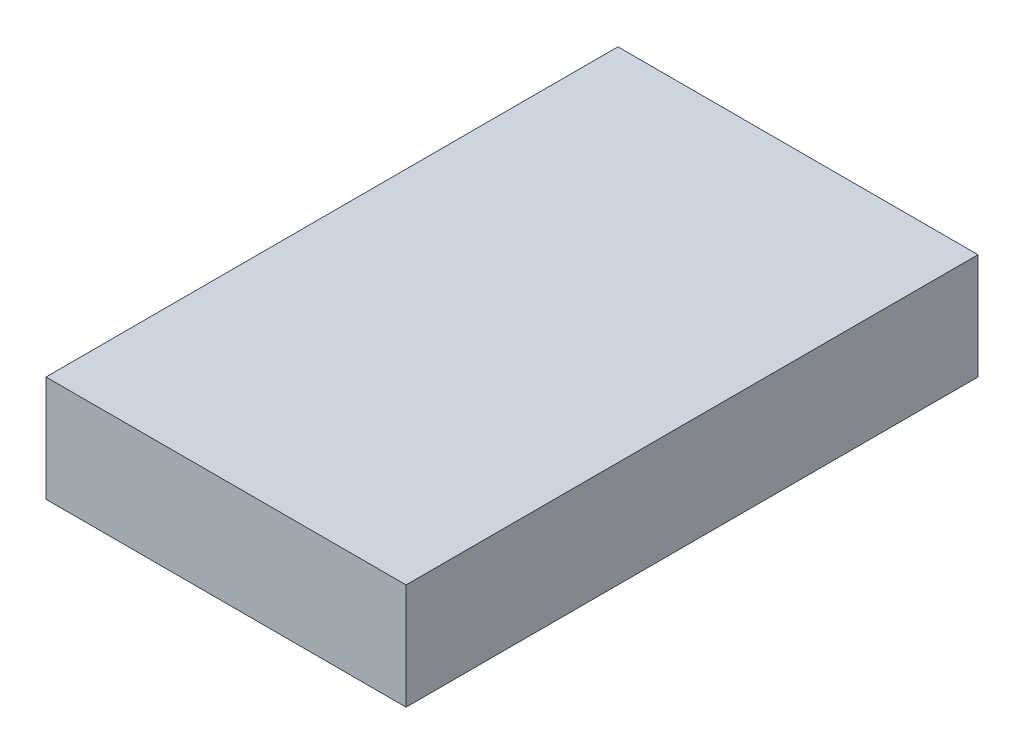
ISO-10303-21;
HEADER;
FILE_DESCRIPTION(('STEP AP214'),'2;1');
FILE_NAME('part.step','',(''),(''),'','','');
FILE_SCHEMA(('AUTOMOTIVE_DESIGN { 1 0 10303 214 1 1 1 1 }'));
ENDSEC;
DATA;
#1=APPLICATION_CONTEXT('core data for automotive mechanical design processes');
#2=APPLICATION_PROTOCOL_DEFINITION('international standard','automotive_design',2000,#1);
#3=PRODUCT_CONTEXT('',#1,'mechanical');
#4=PRODUCT('Part','Part','',(#3));
#5=PRODUCT_RELATED_PRODUCT_CATEGORY('part','',(#4));
#6=PRODUCT_DEFINITION_FORMATION('','',#4);
#7=PRODUCT_DEFINITION_CONTEXT('part definition',#1,'design');
#8=PRODUCT_DEFINITION('design','',#6,#7);
#9=PRODUCT_DEFINITION_SHAPE('','',#8);
#10=(LENGTH_UNIT() NAMED_UNIT(*) SI_UNIT(.MILLI.,.METRE.));
#11=(NAMED_UNIT(*) PLANE_ANGLE_UNIT() SI_UNIT($,.RADIAN.));
#12=(NAMED_UNIT(*) SI_UNIT($,.STERADIAN.) SOLID_ANGLE_UNIT());
#13=UNCERTAINTY_MEASURE_WITH_UNIT(LENGTH_MEASURE(1.E-05),#10,'distance_accuracy_value','');
#14=(GEOMETRIC_REPRESENTATION_CONTEXT(3) GLOBAL_UNCERTAINTY_ASSIGNED_CONTEXT((#13)) GLOBAL_UNIT_ASSIGNED_CONTEXT((#10,
#11,#12)) REPRESENTATION_CONTEXT('',''));
#15=CARTESIAN_POINT('',(0.,0.,0.));
#16=DIRECTION('',(0.,0.,1.));
#17=DIRECTION('',(1.,0.,0.));
#18=AXIS2_PLACEMENT_3D('',#15,#16,#17);
#19=CARTESIAN_POINT('',(0.68,0.4,-1.08));
#20=DIRECTION('',(-1.,0.,0.));
#21=DIRECTION('',(0.,0.,1.));
#22=AXIS2_PLACEMENT_3D('',#19,#20,#21);
#23=PLANE('',#22);
#24=DIRECTION('',(0.,0.,-1.));
#25=VECTOR('',#24,1.);
#26=CARTESIAN_POINT('',(0.68,0.,-1.08));
#27=LINE('',#26,#25);
#28=CARTESIAN_POINT('',(0.68,0.,1.08));
#29=VERTEX_POINT('',#28);
#30=CARTESIAN_POINT('',(0.68,0.,-1.08));
#31=VERTEX_POINT('',#30);
#32=EDGE_CURVE('E97',#29,#31,#27,.T.);
#33=ORIENTED_EDGE('',*,*,#32,.T.);
#34=DIRECTION('',(0.,-1.,0.));
#35=VECTOR('',#34,1.);
#36=CARTESIAN_POINT('',(0.68,0.4,-1.08));
#37=LINE('',#36,#35);
#38=CARTESIAN_POINT('',(0.68,0.4,-1.08));
#39=VERTEX_POINT('',#38);
#40=EDGE_CURVE('E11',#39,#31,#37,.T.);
#41=ORIENTED_EDGE('',*,*,#40,.F.);
#42=DIRECTION('',(0.,0.,-1.));
#43=VECTOR('',#42,1.);
#44=CARTESIAN_POINT('',(0.68,0.4,-1.08));
#45=LINE('',#44,#43);
#46=CARTESIAN_POINT('',(0.68,0.4,1.08));
#47=VERTEX_POINT('',#46);
#48=EDGE_CURVE('E85',#47,#39,#45,.T.);
#49=ORIENTED_EDGE('',*,*,#48,.F.);
#50=DIRECTION('',(0.,-1.,0.));
#51=VECTOR('',#50,1.);
#52=CARTESIAN_POINT('',(0.68,0.4,1.08));
#53=LINE('',#52,#51);
#54=EDGE_CURVE('E93',#47,#29,#53,.T.);
#55=ORIENTED_EDGE('',*,*,#54,.T.);
#56=EDGE_LOOP('',(#33,#41,#49,#55));
#57=FACE_BOUND('',#56,.T.);
#58=ADVANCED_FACE('F34',(#57),#23,.F.);
#59=CARTESIAN_POINT('',(-0.68,0.4,-1.08));
#60=DIRECTION('',(0.,0.,1.));
#61=DIRECTION('',(1.,0.,0.));
#62=AXIS2_PLACEMENT_3D('',#59,#60,#61);
#63=PLANE('',#62);
#64=DIRECTION('',(-1.,0.,0.));
#65=VECTOR('',#64,1.);
#66=CARTESIAN_POINT('',(-0.68,0.,-1.08));
#67=LINE('',#66,#65);
#68=CARTESIAN_POINT('',(-0.68,0.,-1.08));
#69=VERTEX_POINT('',#68);
#70=EDGE_CURVE('E89',#31,#69,#67,.T.);
#71=ORIENTED_EDGE('',*,*,#70,.T.);
#72=DIRECTION('',(0.,-1.,0.));
#73=VECTOR('',#72,1.);
#74=CARTESIAN_POINT('',(-0.68,0.4,-1.08));
#75=LINE('',#74,#73);
#76=CARTESIAN_POINT('',(-0.68,0.4,-1.08));
#77=VERTEX_POINT('',#76);
#78=EDGE_CURVE('E42',#77,#69,#75,.T.);
#79=ORIENTED_EDGE('',*,*,#78,.F.);
#80=DIRECTION('',(-1.,0.,0.));
#81=VECTOR('',#80,1.);
#82=CARTESIAN_POINT('',(-0.68,0.4,-1.08));
#83=LINE('',#82,#81);
#84=EDGE_CURVE('E80',#39,#77,#83,.T.);
#85=ORIENTED_EDGE('',*,*,#84,.F.);
#86=ORIENTED_EDGE('',*,*,#40,.T.);
#87=EDGE_LOOP('',(#71,#79,#85,#86));
#88=FACE_BOUND('',#87,.T.);
#89=ADVANCED_FACE('F88',(#88),#63,.F.);
#90=CARTESIAN_POINT('',(-0.68,0.4,-1.08));
#91=DIRECTION('',(1.,0.,0.));
#92=DIRECTION('',(0.,0.,-1.));
#93=AXIS2_PLACEMENT_3D('',#90,#91,#92);
#94=PLANE('',#93);
#95=DIRECTION('',(0.,0.,1.));
#96=VECTOR('',#95,1.);
#97=CARTESIAN_POINT('',(-0.68,0.,-1.08));
#98=LINE('',#97,#96);
#99=CARTESIAN_POINT('',(-0.68,0.,1.08));
#100=VERTEX_POINT('',#99);
#101=EDGE_CURVE('E67',#69,#100,#98,.T.);
#102=ORIENTED_EDGE('',*,*,#101,.T.);
#103=DIRECTION('',(0.,-1.,0.));
#104=VECTOR('',#103,1.);
#105=CARTESIAN_POINT('',(-0.68,0.4,1.08));
#106=LINE('',#105,#104);
#107=CARTESIAN_POINT('',(-0.68,0.4,1.08));
#108=VERTEX_POINT('',#107);
#109=EDGE_CURVE('E90',#108,#100,#106,.T.);
#110=ORIENTED_EDGE('',*,*,#109,.F.);
#111=DIRECTION('',(0.,0.,1.));
#112=VECTOR('',#111,1.);
#113=CARTESIAN_POINT('',(-0.68,0.4,-1.08));
#114=LINE('',#113,#112);
#115=EDGE_CURVE('E83',#77,#108,#114,.T.);
#116=ORIENTED_EDGE('',*,*,#115,.F.);
#117=ORIENTED_EDGE('',*,*,#78,.T.);
#118=EDGE_LOOP('',(#102,#110,#116,#117));
#119=FACE_BOUND('',#118,.T.);
#120=ADVANCED_FACE('F91',(#119),#94,.F.);
#121=CARTESIAN_POINT('',(-0.68,0.4,1.08));
#122=DIRECTION('',(0.,0.,-1.));
#123=DIRECTION('',(-1.,0.,0.));
#124=AXIS2_PLACEMENT_3D('',#121,#122,#123);
#125=PLANE('',#124);
#126=DIRECTION('',(1.,0.,0.));
#127=VECTOR('',#126,1.);
#128=CARTESIAN_POINT('',(-0.68,0.,1.08));
#129=LINE('',#128,#127);
#130=EDGE_CURVE('E73',#100,#29,#129,.T.);
#131=ORIENTED_EDGE('',*,*,#130,.T.);
#132=ORIENTED_EDGE('',*,*,#54,.F.);
#133=DIRECTION('',(1.,0.,0.));
#134=VECTOR('',#133,1.);
#135=CARTESIAN_POINT('',(-0.68,0.4,1.08));
#136=LINE('',#135,#134);
#137=EDGE_CURVE('E50',#108,#47,#136,.T.);
#138=ORIENTED_EDGE('',*,*,#137,.F.);
#139=ORIENTED_EDGE('',*,*,#109,.T.);
#140=EDGE_LOOP('',(#131,#132,#138,#139));
#141=FACE_BOUND('',#140,.T.);
#142=ADVANCED_FACE('F104',(#141),#125,.F.);
#143=CARTESIAN_POINT('',(0.,0.4,0.));
#144=DIRECTION('',(0.,1.,0.));
#145=DIRECTION('',(0.,0.,1.));
#146=AXIS2_PLACEMENT_3D('',#143,#144,#145);
#147=PLANE('',#146);
#148=ORIENTED_EDGE('',*,*,#48,.T.);
#149=ORIENTED_EDGE('',*,*,#84,.T.);
#150=ORIENTED_EDGE('',*,*,#115,.T.);
#151=ORIENTED_EDGE('',*,*,#137,.T.);
#152=EDGE_LOOP('',(#148,#149,#150,#151));
#153=FACE_BOUND('',#152,.T.);
#154=ADVANCED_FACE('F81',(#153),#147,.T.);
#155=CARTESIAN_POINT('',(0.,0.,0.));
#156=DIRECTION('',(0.,1.,0.));
#157=DIRECTION('',(0.,0.,1.));
#158=AXIS2_PLACEMENT_3D('',#155,#156,#157);
#159=PLANE('',#158);
#160=ORIENTED_EDGE('',*,*,#32,.F.);
#161=ORIENTED_EDGE('',*,*,#130,.F.);
#162=ORIENTED_EDGE('',*,*,#101,.F.);
#163=ORIENTED_EDGE('',*,*,#70,.F.);
#164=EDGE_LOOP('',(#160,#161,#162,#163));
#165=FACE_BOUND('',#164,.T.);
#166=ADVANCED_FACE('F107',(#165),#159,.F.);
#167=CLOSED_SHELL('',(#58,#89,#120,#142,#154,#166));
#168=MANIFOLD_SOLID_BREP('B2',#167);
#169=ADVANCED_BREP_SHAPE_REPRESENTATION('',(#18,#168),#14);
#170=SHAPE_DEFINITION_REPRESENTATION(#9,#169);
ENDSEC;
END-ISO-10303-21;
